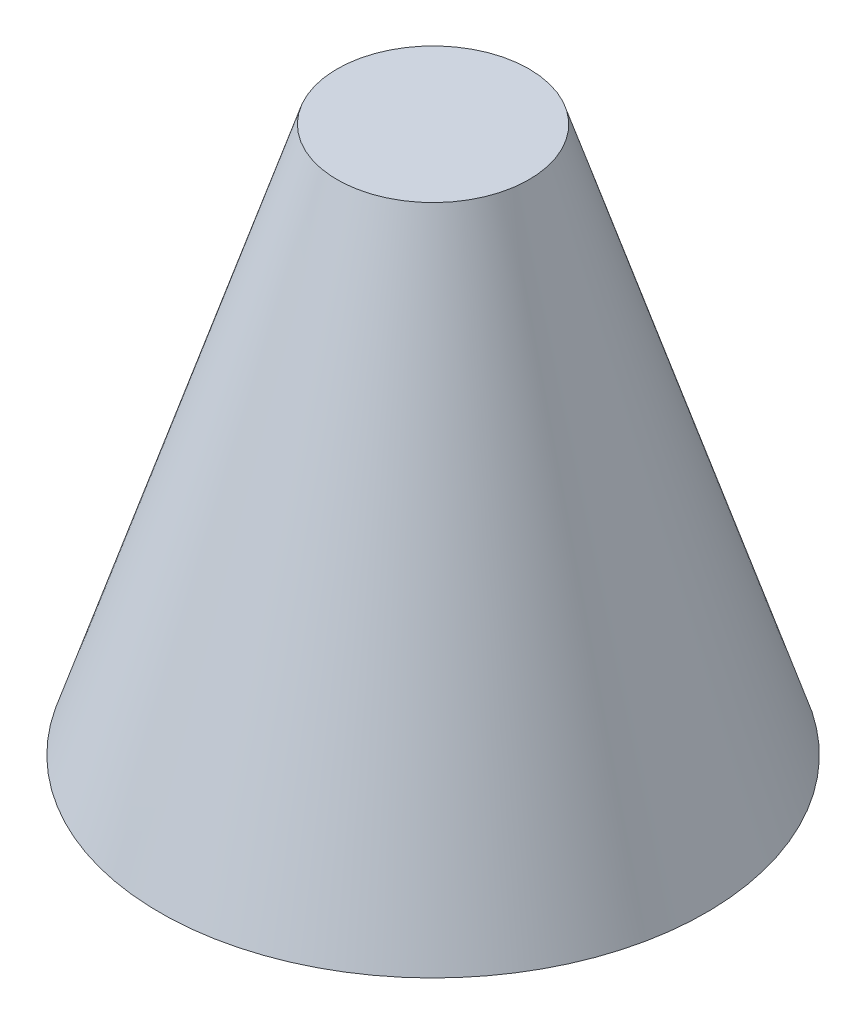
ISO-10303-21;
HEADER;
FILE_DESCRIPTION(('STEP AP214'),'2;1');
FILE_NAME('part.step','',(''),(''),'','','');
FILE_SCHEMA(('AUTOMOTIVE_DESIGN { 1 0 10303 214 1 1 1 1 }'));
ENDSEC;
DATA;
#1=APPLICATION_CONTEXT('core data for automotive mechanical design processes');
#2=APPLICATION_PROTOCOL_DEFINITION('international standard','automotive_design',2000,#1);
#3=PRODUCT_CONTEXT('',#1,'mechanical');
#4=PRODUCT('Part','Part','',(#3));
#5=PRODUCT_RELATED_PRODUCT_CATEGORY('part','',(#4));
#6=PRODUCT_DEFINITION_FORMATION('','',#4);
#7=PRODUCT_DEFINITION_CONTEXT('part definition',#1,'design');
#8=PRODUCT_DEFINITION('design','',#6,#7);
#9=PRODUCT_DEFINITION_SHAPE('','',#8);
#10=(LENGTH_UNIT() NAMED_UNIT(*) SI_UNIT(.MILLI.,.METRE.));
#11=(NAMED_UNIT(*) PLANE_ANGLE_UNIT() SI_UNIT($,.RADIAN.));
#12=(NAMED_UNIT(*) SI_UNIT($,.STERADIAN.) SOLID_ANGLE_UNIT());
#13=UNCERTAINTY_MEASURE_WITH_UNIT(LENGTH_MEASURE(1.E-05),#10,'distance_accuracy_value','');
#14=(GEOMETRIC_REPRESENTATION_CONTEXT(3) GLOBAL_UNCERTAINTY_ASSIGNED_CONTEXT((#13)) GLOBAL_UNIT_ASSIGNED_CONTEXT((#10,
#11,#12)) REPRESENTATION_CONTEXT('',''));
#15=CARTESIAN_POINT('',(0.,0.,0.));
#16=DIRECTION('',(0.,0.,1.));
#17=DIRECTION('',(1.,0.,0.));
#18=AXIS2_PLACEMENT_3D('',#15,#16,#17);
#19=CARTESIAN_POINT('',(37.,-0.545321133724034,0.));
#20=DIRECTION('',(0.,-1.,0.));
#21=DIRECTION('',(0.,0.,-1.));
#22=AXIS2_PLACEMENT_3D('',#19,#20,#21);
#23=PLANE('',#22);
#24=CARTESIAN_POINT('',(0.,-0.545321133724034,0.));
#25=DIRECTION('',(0.,-1.,0.));
#26=DIRECTION('',(0.,0.,-1.));
#27=AXIS2_PLACEMENT_3D('',#24,#25,#26);
#28=CIRCLE('',#27,37.);
#29=CARTESIAN_POINT('',(0.,-0.545321133724034,-37.));
#30=VERTEX_POINT('',#29);
#31=EDGE_CURVE('E44',#30,#30,#28,.T.);
#32=ORIENTED_EDGE('',*,*,#31,.T.);
#33=EDGE_LOOP('',(#32));
#34=FACE_BOUND('',#33,.T.);
#35=ADVANCED_FACE('F37',(#34),#23,.T.);
#36=CARTESIAN_POINT('',(0.,73.454678866276,0.));
#37=DIRECTION('',(0.,1.,0.));
#38=DIRECTION('',(0.,0.,1.));
#39=AXIS2_PLACEMENT_3D('',#36,#37,#38);
#40=PLANE('',#39);
#41=CARTESIAN_POINT('',(0.,73.454678866276,0.));
#42=DIRECTION('',(0.,-1.,0.));
#43=DIRECTION('',(0.,0.,-1.));
#44=AXIS2_PLACEMENT_3D('',#41,#42,#43);
#45=CIRCLE('',#44,13.);
#46=CARTESIAN_POINT('',(0.,73.454678866276,-13.));
#47=VERTEX_POINT('',#46);
#48=EDGE_CURVE('E10',#47,#47,#45,.T.);
#49=ORIENTED_EDGE('',*,*,#48,.F.);
#50=EDGE_LOOP('',(#49));
#51=FACE_BOUND('',#50,.T.);
#52=ADVANCED_FACE('F54',(#51),#40,.T.);
#53=CARTESIAN_POINT('',(0.,-0.545321133724034,0.));
#54=DIRECTION('',(0.,-1.,0.));
#55=DIRECTION('',(0.,0.,-1.));
#56=AXIS2_PLACEMENT_3D('',#53,#54,#55);
#57=CONICAL_SURFACE('',#56,37.,0.313620652216698);
#58=ORIENTED_EDGE('',*,*,#48,.T.);
#59=EDGE_LOOP('',(#58));
#60=FACE_BOUND('',#59,.T.);
#61=ORIENTED_EDGE('',*,*,#31,.F.);
#62=EDGE_LOOP('',(#61));
#63=FACE_BOUND('',#62,.T.);
#64=ADVANCED_FACE('F52',(#60,#63),#57,.T.);
#65=CLOSED_SHELL('',(#35,#52,#64));
#66=MANIFOLD_SOLID_BREP('B2',#65);
#67=ADVANCED_BREP_SHAPE_REPRESENTATION('',(#18,#66),#14);
#68=SHAPE_DEFINITION_REPRESENTATION(#9,#67);
ENDSEC;
END-ISO-10303-21;
